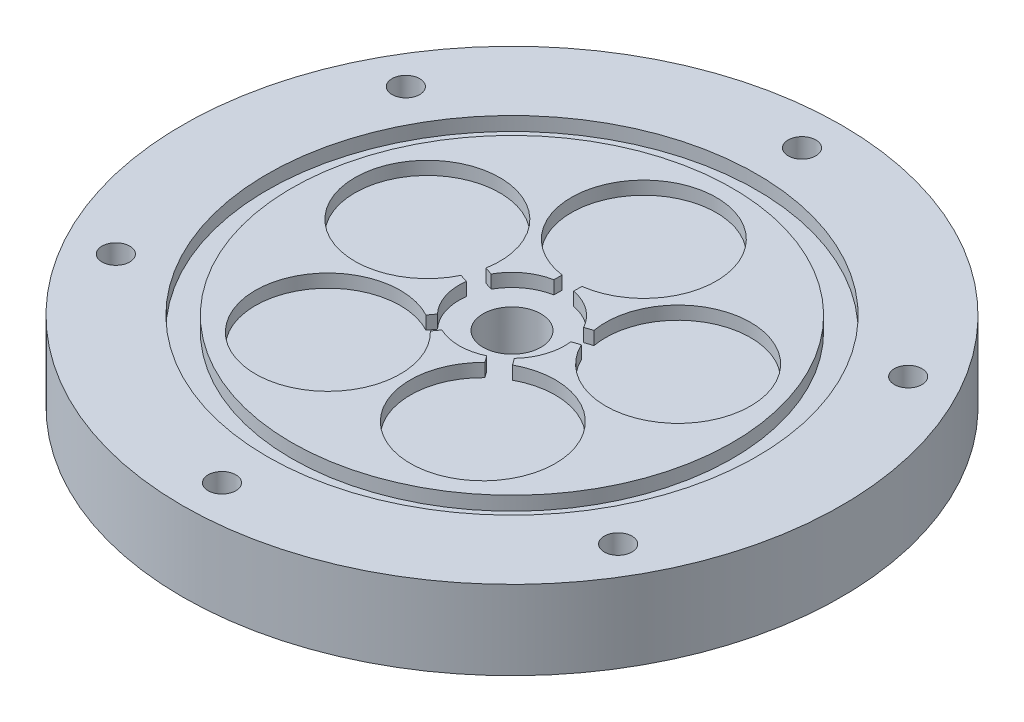
ISO-10303-21;
HEADER;
FILE_DESCRIPTION(('STEP AP214'),'2;1');
FILE_NAME('part.step','',(''),(''),'','','');
FILE_SCHEMA(('AUTOMOTIVE_DESIGN { 1 0 10303 214 1 1 1 1 }'));
ENDSEC;
DATA;
#1=APPLICATION_CONTEXT('core data for automotive mechanical design processes');
#2=APPLICATION_PROTOCOL_DEFINITION('international standard','automotive_design',2000,#1);
#3=PRODUCT_CONTEXT('',#1,'mechanical');
#4=PRODUCT('Part','Part','',(#3));
#5=PRODUCT_RELATED_PRODUCT_CATEGORY('part','',(#4));
#6=PRODUCT_DEFINITION_FORMATION('','',#4);
#7=PRODUCT_DEFINITION_CONTEXT('part definition',#1,'design');
#8=PRODUCT_DEFINITION('design','',#6,#7);
#9=PRODUCT_DEFINITION_SHAPE('','',#8);
#10=(LENGTH_UNIT() NAMED_UNIT(*) SI_UNIT(.MILLI.,.METRE.));
#11=(NAMED_UNIT(*) PLANE_ANGLE_UNIT() SI_UNIT($,.RADIAN.));
#12=(NAMED_UNIT(*) SI_UNIT($,.STERADIAN.) SOLID_ANGLE_UNIT());
#13=UNCERTAINTY_MEASURE_WITH_UNIT(LENGTH_MEASURE(1.E-05),#10,'distance_accuracy_value','');
#14=(GEOMETRIC_REPRESENTATION_CONTEXT(3) GLOBAL_UNCERTAINTY_ASSIGNED_CONTEXT((#13)) GLOBAL_UNIT_ASSIGNED_CONTEXT((#10,
#11,#12)) REPRESENTATION_CONTEXT('',''));
#15=CARTESIAN_POINT('',(0.,0.,0.));
#16=DIRECTION('',(0.,0.,1.));
#17=DIRECTION('',(1.,0.,0.));
#18=AXIS2_PLACEMENT_3D('',#15,#16,#17);
#19=CARTESIAN_POINT('',(0.,0.,0.));
#20=DIRECTION('',(0.,1.,0.));
#21=DIRECTION('',(0.,0.,1.));
#22=AXIS2_PLACEMENT_3D('',#19,#20,#21);
#23=PLANE('',#22);
#24=CARTESIAN_POINT('',(0.,0.,0.));
#25=DIRECTION('',(0.,1.,0.));
#26=DIRECTION('',(0.,0.,1.));
#27=AXIS2_PLACEMENT_3D('',#24,#25,#26);
#28=CIRCLE('',#27,33.435);
#29=CARTESIAN_POINT('',(0.,0.,33.435));
#30=VERTEX_POINT('',#29);
#31=EDGE_CURVE('E47',#30,#30,#28,.T.);
#32=ORIENTED_EDGE('',*,*,#31,.T.);
#33=EDGE_LOOP('',(#32));
#34=FACE_BOUND('',#33,.T.);
#35=DIRECTION('',(-0.951056516295155,0.,-0.309016994374945));
#36=VECTOR('',#35,1.);
#37=CARTESIAN_POINT('',(-18.5576048343407,0.,-7.60692466194163));
#38=LINE('',#37,#36);
#39=CARTESIAN_POINT('',(-7.00998771852336,0.,-3.85487641645639));
#40=VERTEX_POINT('',#39);
#41=CARTESIAN_POINT('',(-8.19370672402462,0.,-4.23949003614898));
#42=VERTEX_POINT('',#41);
#43=EDGE_CURVE('E385',#40,#42,#38,.T.);
#44=ORIENTED_EDGE('',*,*,#43,.F.);
#45=CARTESIAN_POINT('',(0.,0.,0.));
#46=DIRECTION('',(0.,1.,0.));
#47=DIRECTION('',(0.,0.,1.));
#48=AXIS2_PLACEMENT_3D('',#45,#46,#47);
#49=CIRCLE('',#48,8.);
#50=CARTESIAN_POINT('',(-1.5,0.,-7.85811682275086));
#51=VERTEX_POINT('',#50);
#52=EDGE_CURVE('E224',#51,#40,#49,.T.);
#53=ORIENTED_EDGE('',*,*,#52,.F.);
#54=DIRECTION('',(0.,0.,1.));
#55=VECTOR('',#54,1.);
#56=CARTESIAN_POINT('',(-1.5,0.,-20.));
#57=LINE('',#56,#55);
#58=CARTESIAN_POINT('',(-1.5,0.,-9.10275264114832));
#59=VERTEX_POINT('',#58);
#60=EDGE_CURVE('E318',#59,#51,#57,.T.);
#61=ORIENTED_EDGE('',*,*,#60,.F.);
#62=CARTESIAN_POINT('',(0.,0.,-20.));
#63=DIRECTION('',(0.,1.,0.));
#64=DIRECTION('',(0.,0.,1.));
#65=AXIS2_PLACEMENT_3D('',#62,#63,#64);
#66=CIRCLE('',#65,11.);
#67=CARTESIAN_POINT('',(1.5,0.,-9.10275264114832));
#68=VERTEX_POINT('',#67);
#69=EDGE_CURVE('E212',#68,#59,#66,.T.);
#70=ORIENTED_EDGE('',*,*,#69,.F.);
#71=DIRECTION('',(0.,0.,-1.));
#72=VECTOR('',#71,1.);
#73=CARTESIAN_POINT('',(1.5,0.,-20.));
#74=LINE('',#73,#72);
#75=CARTESIAN_POINT('',(1.5,0.,-7.85811682275086));
#76=VERTEX_POINT('',#75);
#77=EDGE_CURVE('E322',#76,#68,#74,.T.);
#78=ORIENTED_EDGE('',*,*,#77,.F.);
#79=CARTESIAN_POINT('',(7.00998771852331,0.,-3.85487641645649));
#80=VERTEX_POINT('',#79);
#81=EDGE_CURVE('E232',#80,#76,#49,.T.);
#82=ORIENTED_EDGE('',*,*,#81,.F.);
#83=DIRECTION('',(-0.95105651629515,0.,0.309016994374958));
#84=VECTOR('',#83,1.);
#85=CARTESIAN_POINT('',(18.5576048343406,0.,-7.60692466194189));
#86=LINE('',#85,#84);
#87=CARTESIAN_POINT('',(8.19370672402456,0.,-4.23949003614909));
#88=VERTEX_POINT('',#87);
#89=EDGE_CURVE('E189',#88,#80,#86,.T.);
#90=ORIENTED_EDGE('',*,*,#89,.F.);
#91=CARTESIAN_POINT('',(19.021130325903,0.,-6.18033988749916));
#92=DIRECTION('',(0.,1.,0.));
#93=DIRECTION('',(-0.95105651629515,0.,0.309016994374958));
#94=AXIS2_PLACEMENT_3D('',#91,#92,#93);
#95=CIRCLE('',#94,11.);
#96=CARTESIAN_POINT('',(9.12075770714943,0.,-1.38632048726364));
#97=VERTEX_POINT('',#96);
#98=EDGE_CURVE('E890',#97,#88,#95,.T.);
#99=ORIENTED_EDGE('',*,*,#98,.F.);
#100=DIRECTION('',(0.95105651629515,0.,-0.309016994374958));
#101=VECTOR('',#100,1.);
#102=CARTESIAN_POINT('',(19.4846558174654,0.,-4.75375511305644));
#103=LINE('',#102,#101);
#104=CARTESIAN_POINT('',(7.93703870164818,0.,-1.00170686757104));
#105=VERTEX_POINT('',#104);
#106=EDGE_CURVE('E340',#105,#97,#103,.T.);
#107=ORIENTED_EDGE('',*,*,#106,.F.);
#108=CARTESIAN_POINT('',(5.83241067076681,0.,5.47567217495035));
#109=VERTEX_POINT('',#108);
#110=EDGE_CURVE('E237',#109,#105,#49,.T.);
#111=ORIENTED_EDGE('',*,*,#110,.F.);
#112=DIRECTION('',(-0.58778525229248,0.,-0.809016994374942));
#113=VECTOR('',#112,1.);
#114=CARTESIAN_POINT('',(12.969230537412,0.,15.2986620090601));
#115=LINE('',#114,#113);
#116=CARTESIAN_POINT('',(6.56398924929582,0.,6.48260370384166));
#117=VERTEX_POINT('',#116);
#118=EDGE_CURVE('E205',#117,#109,#115,.T.);
#119=ORIENTED_EDGE('',*,*,#118,.F.);
#120=CARTESIAN_POINT('',(11.7557050458496,0.,16.1803398874988));
#121=DIRECTION('',(0.,1.,0.));
#122=DIRECTION('',(-0.58778525229248,0.,-0.809016994374942));
#123=AXIS2_PLACEMENT_3D('',#120,#121,#122);
#124=CIRCLE('',#123,11.);
#125=CARTESIAN_POINT('',(4.13693826617099,0.,8.2459594607191));
#126=VERTEX_POINT('',#125);
#127=EDGE_CURVE('E970',#126,#117,#124,.T.);
#128=ORIENTED_EDGE('',*,*,#127,.F.);
#129=DIRECTION('',(0.58778525229248,0.,0.809016994374942));
#130=VECTOR('',#129,1.);
#131=CARTESIAN_POINT('',(10.5421795542872,0.,17.0620177659376));
#132=LINE('',#131,#130);
#133=CARTESIAN_POINT('',(3.40535968764198,0.,7.23902793182779));
#134=VERTEX_POINT('',#133);
#135=EDGE_CURVE('E353',#134,#126,#132,.T.);
#136=ORIENTED_EDGE('',*,*,#135,.F.);
#137=CARTESIAN_POINT('',(-3.40535968764188,0.,7.23902793182784));
#138=VERTEX_POINT('',#137);
#139=EDGE_CURVE('E235',#138,#134,#49,.T.);
#140=ORIENTED_EDGE('',*,*,#139,.F.);
#141=DIRECTION('',(0.587785252292469,0.,-0.809016994374951));
#142=VECTOR('',#141,1.);
#143=CARTESIAN_POINT('',(-10.5421795542869,0.,17.0620177659377));
#144=LINE('',#143,#142);
#145=CARTESIAN_POINT('',(-4.13693826617087,0.,8.24595946071916));
#146=VERTEX_POINT('',#145);
#147=EDGE_CURVE('E367',#146,#138,#144,.T.);
#148=ORIENTED_EDGE('',*,*,#147,.F.);
#149=CARTESIAN_POINT('',(-11.7557050458494,0.,16.180339887499));
#150=DIRECTION('',(0.,1.,0.));
#151=DIRECTION('',(0.587785252292469,0.,-0.809016994374951));
#152=AXIS2_PLACEMENT_3D('',#149,#150,#151);
#153=CIRCLE('',#152,11.);
#154=CARTESIAN_POINT('',(-6.56398924929572,0.,6.48260370384175));
#155=VERTEX_POINT('',#154);
#156=EDGE_CURVE('E915',#155,#146,#153,.T.);
#157=ORIENTED_EDGE('',*,*,#156,.F.);
#158=DIRECTION('',(-0.587785252292469,0.,0.809016994374951));
#159=VECTOR('',#158,1.);
#160=CARTESIAN_POINT('',(-12.9692305374118,0.,15.2986620090603));
#161=LINE('',#160,#159);
#162=CARTESIAN_POINT('',(-5.83241067076673,0.,5.47567217495043));
#163=VERTEX_POINT('',#162);
#164=EDGE_CURVE('E370',#163,#155,#161,.T.);
#165=ORIENTED_EDGE('',*,*,#164,.F.);
#166=CARTESIAN_POINT('',(-7.93703870164819,0.,-1.00170686757093));
#167=VERTEX_POINT('',#166);
#168=EDGE_CURVE('E231',#167,#163,#49,.T.);
#169=ORIENTED_EDGE('',*,*,#168,.F.);
#170=DIRECTION('',(0.951056516295155,0.,0.309016994374945));
#171=VECTOR('',#170,1.);
#172=CARTESIAN_POINT('',(-19.4846558174655,0.,-4.75375511305616));
#173=LINE('',#172,#171);
#174=CARTESIAN_POINT('',(-9.12075770714945,0.,-1.38632048726351));
#175=VERTEX_POINT('',#174);
#176=EDGE_CURVE('E382',#175,#167,#173,.T.);
#177=ORIENTED_EDGE('',*,*,#176,.F.);
#178=CARTESIAN_POINT('',(-19.0211303259031,0.,-6.1803398874989));
#179=DIRECTION('',(0.,1.,0.));
#180=DIRECTION('',(0.951056516295155,0.,0.309016994374945));
#181=AXIS2_PLACEMENT_3D('',#178,#179,#180);
#182=CIRCLE('',#181,11.);
#183=EDGE_CURVE('E914',#42,#175,#182,.T.);
#184=ORIENTED_EDGE('',*,*,#183,.F.);
#185=EDGE_LOOP('',(#44,#53,#61,#70,#78,#82,#90,#99,#107,#111,#119,#128,#136,#140,#148,#157,#165,
#169,#177,#184));
#186=FACE_BOUND('',#185,.T.);
#187=ADVANCED_FACE('F43',(#34,#186),#23,.T.);
#188=CARTESIAN_POINT('',(0.,-24.6274169979695,0.));
#189=DIRECTION('',(0.,1.,0.));
#190=DIRECTION('',(0.,0.,1.));
#191=AXIS2_PLACEMENT_3D('',#188,#189,#190);
#192=CYLINDRICAL_SURFACE('',#191,8.);
#193=ORIENTED_EDGE('',*,*,#52,.T.);
#194=DIRECTION('',(0.,1.,0.));
#195=VECTOR('',#194,1.);
#196=CARTESIAN_POINT('',(-7.00998771852336,-24.6274169979695,-3.85487641645639));
#197=LINE('',#196,#195);
#198=CARTESIAN_POINT('',(-7.00998771852336,-2.,-3.85487641645639));
#199=VERTEX_POINT('',#198);
#200=EDGE_CURVE('E886',#40,#199,#197,.F.);
#201=ORIENTED_EDGE('',*,*,#200,.T.);
#202=CARTESIAN_POINT('',(0.,-2.,0.));
#203=DIRECTION('',(0.,1.,0.));
#204=DIRECTION('',(0.,0.,1.));
#205=AXIS2_PLACEMENT_3D('',#202,#203,#204);
#206=CIRCLE('',#205,8.);
#207=CARTESIAN_POINT('',(-1.5,-2.,-7.85811682275086));
#208=VERTEX_POINT('',#207);
#209=EDGE_CURVE('E215',#199,#208,#206,.F.);
#210=ORIENTED_EDGE('',*,*,#209,.T.);
#211=DIRECTION('',(0.,1.,0.));
#212=VECTOR('',#211,1.);
#213=CARTESIAN_POINT('',(-1.5,-24.6274169979695,-7.85811682275086));
#214=LINE('',#213,#212);
#215=EDGE_CURVE('E894',#208,#51,#214,.T.);
#216=ORIENTED_EDGE('',*,*,#215,.T.);
#217=EDGE_LOOP('',(#193,#201,#210,#216));
#218=FACE_BOUND('',#217,.T.);
#219=ADVANCED_FACE('F422',(#218),#192,.F.);
#220=CARTESIAN_POINT('',(-5.83241067076673,-2.,5.47567217495043));
#221=VERTEX_POINT('',#220);
#222=CARTESIAN_POINT('',(-7.93703870164819,-2.,-1.00170686757093));
#223=VERTEX_POINT('',#222);
#224=EDGE_CURVE('E223',#221,#223,#206,.F.);
#225=ORIENTED_EDGE('',*,*,#224,.T.);
#226=DIRECTION('',(0.,1.,0.));
#227=VECTOR('',#226,1.);
#228=CARTESIAN_POINT('',(-7.93703870164819,-24.6274169979695,-1.00170686757093));
#229=LINE('',#228,#227);
#230=EDGE_CURVE('E877',#223,#167,#229,.T.);
#231=ORIENTED_EDGE('',*,*,#230,.T.);
#232=ORIENTED_EDGE('',*,*,#168,.T.);
#233=DIRECTION('',(0.,1.,0.));
#234=VECTOR('',#233,1.);
#235=CARTESIAN_POINT('',(-5.83241067076673,-24.6274169979695,5.47567217495043));
#236=LINE('',#235,#234);
#237=EDGE_CURVE('E879',#163,#221,#236,.F.);
#238=ORIENTED_EDGE('',*,*,#237,.T.);
#239=EDGE_LOOP('',(#225,#231,#232,#238));
#240=FACE_BOUND('',#239,.T.);
#241=ADVANCED_FACE('F427',(#240),#192,.F.);
#242=CARTESIAN_POINT('',(3.40535968764198,-2.,7.23902793182779));
#243=VERTEX_POINT('',#242);
#244=CARTESIAN_POINT('',(-3.40535968764188,-2.,7.23902793182784));
#245=VERTEX_POINT('',#244);
#246=EDGE_CURVE('E220',#243,#245,#206,.F.);
#247=ORIENTED_EDGE('',*,*,#246,.T.);
#248=DIRECTION('',(0.,1.,0.));
#249=VECTOR('',#248,1.);
#250=CARTESIAN_POINT('',(-3.40535968764188,-24.6274169979695,7.23902793182784));
#251=LINE('',#250,#249);
#252=EDGE_CURVE('E939',#245,#138,#251,.T.);
#253=ORIENTED_EDGE('',*,*,#252,.T.);
#254=ORIENTED_EDGE('',*,*,#139,.T.);
#255=DIRECTION('',(0.,1.,0.));
#256=VECTOR('',#255,1.);
#257=CARTESIAN_POINT('',(3.40535968764198,-24.6274169979695,7.23902793182779));
#258=LINE('',#257,#256);
#259=EDGE_CURVE('E952',#134,#243,#258,.F.);
#260=ORIENTED_EDGE('',*,*,#259,.T.);
#261=EDGE_LOOP('',(#247,#253,#254,#260));
#262=FACE_BOUND('',#261,.T.);
#263=ADVANCED_FACE('F418',(#262),#192,.F.);
#264=CARTESIAN_POINT('',(7.93703870164818,-2.,-1.00170686757104));
#265=VERTEX_POINT('',#264);
#266=CARTESIAN_POINT('',(5.83241067076681,-2.,5.47567217495035));
#267=VERTEX_POINT('',#266);
#268=EDGE_CURVE('E213',#265,#267,#206,.F.);
#269=ORIENTED_EDGE('',*,*,#268,.T.);
#270=DIRECTION('',(0.,1.,0.));
#271=VECTOR('',#270,1.);
#272=CARTESIAN_POINT('',(5.83241067076681,-24.6274169979695,5.47567217495035));
#273=LINE('',#272,#271);
#274=EDGE_CURVE('E953',#267,#109,#273,.T.);
#275=ORIENTED_EDGE('',*,*,#274,.T.);
#276=ORIENTED_EDGE('',*,*,#110,.T.);
#277=DIRECTION('',(0.,1.,0.));
#278=VECTOR('',#277,1.);
#279=CARTESIAN_POINT('',(7.93703870164818,-24.6274169979695,-1.00170686757104));
#280=LINE('',#279,#278);
#281=EDGE_CURVE('E1030',#105,#265,#280,.F.);
#282=ORIENTED_EDGE('',*,*,#281,.T.);
#283=EDGE_LOOP('',(#269,#275,#276,#282));
#284=FACE_BOUND('',#283,.T.);
#285=ADVANCED_FACE('F410',(#284),#192,.F.);
#286=CARTESIAN_POINT('',(0.,-12.,0.));
#287=DIRECTION('',(0.,1.,0.));
#288=DIRECTION('',(0.,0.,1.));
#289=AXIS2_PLACEMENT_3D('',#286,#287,#288);
#290=CYLINDRICAL_SURFACE('',#289,50.);
#291=CARTESIAN_POINT('',(0.,-12.,0.));
#292=DIRECTION('',(0.,1.,0.));
#293=DIRECTION('',(0.,0.,1.));
#294=AXIS2_PLACEMENT_3D('',#291,#292,#293);
#295=CIRCLE('',#294,50.);
#296=CARTESIAN_POINT('',(0.,-12.,50.));
#297=VERTEX_POINT('',#296);
#298=EDGE_CURVE('E12',#297,#297,#295,.T.);
#299=ORIENTED_EDGE('',*,*,#298,.T.);
#300=EDGE_LOOP('',(#299));
#301=FACE_BOUND('',#300,.T.);
#302=CARTESIAN_POINT('',(0.,0.,0.));
#303=DIRECTION('',(0.,1.,0.));
#304=DIRECTION('',(0.,0.,1.));
#305=AXIS2_PLACEMENT_3D('',#302,#303,#304);
#306=CIRCLE('',#305,50.);
#307=CARTESIAN_POINT('',(0.,0.,50.));
#308=VERTEX_POINT('',#307);
#309=EDGE_CURVE('E53',#308,#308,#306,.T.);
#310=ORIENTED_EDGE('',*,*,#309,.F.);
#311=EDGE_LOOP('',(#310));
#312=FACE_BOUND('',#311,.T.);
#313=ADVANCED_FACE('F45',(#301,#312),#290,.T.);
#314=CARTESIAN_POINT('',(0.,-12.,0.));
#315=DIRECTION('',(0.,1.,0.));
#316=DIRECTION('',(0.,0.,1.));
#317=AXIS2_PLACEMENT_3D('',#314,#315,#316);
#318=PLANE('',#317);
#319=CARTESIAN_POINT('',(-38.105117766515,-12.,-22.0000000000004));
#320=DIRECTION('',(0.,1.,0.));
#321=DIRECTION('',(0.,0.,1.));
#322=AXIS2_PLACEMENT_3D('',#319,#320,#321);
#323=CIRCLE('',#322,2.1);
#324=CARTESIAN_POINT('',(-38.105117766515,-12.,-19.9000000000004));
#325=VERTEX_POINT('',#324);
#326=EDGE_CURVE('E998',#325,#325,#323,.T.);
#327=ORIENTED_EDGE('',*,*,#326,.T.);
#328=EDGE_LOOP('',(#327));
#329=FACE_BOUND('',#328,.T.);
#330=CARTESIAN_POINT('',(-38.1051177665155,-12.,21.9999999999996));
#331=DIRECTION('',(0.,1.,0.));
#332=DIRECTION('',(0.,0.,1.));
#333=AXIS2_PLACEMENT_3D('',#330,#331,#332);
#334=CIRCLE('',#333,2.1);
#335=CARTESIAN_POINT('',(-38.1051177665155,-12.,24.0999999999996));
#336=VERTEX_POINT('',#335);
#337=EDGE_CURVE('E282',#336,#336,#334,.T.);
#338=ORIENTED_EDGE('',*,*,#337,.T.);
#339=EDGE_LOOP('',(#338));
#340=FACE_BOUND('',#339,.T.);
#341=CARTESIAN_POINT('',(0.,-12.,44.));
#342=DIRECTION('',(0.,1.,0.));
#343=DIRECTION('',(0.,0.,1.));
#344=AXIS2_PLACEMENT_3D('',#341,#342,#343);
#345=CIRCLE('',#344,2.1);
#346=CARTESIAN_POINT('',(0.,-12.,46.1));
#347=VERTEX_POINT('',#346);
#348=EDGE_CURVE('E261',#347,#347,#345,.T.);
#349=ORIENTED_EDGE('',*,*,#348,.T.);
#350=EDGE_LOOP('',(#349));
#351=FACE_BOUND('',#350,.T.);
#352=CARTESIAN_POINT('',(38.1051177665152,-12.,22.0000000000002));
#353=DIRECTION('',(0.,1.,0.));
#354=DIRECTION('',(0.,0.,1.));
#355=AXIS2_PLACEMENT_3D('',#352,#353,#354);
#356=CIRCLE('',#355,2.1);
#357=CARTESIAN_POINT('',(38.1051177665152,-12.,24.1000000000002));
#358=VERTEX_POINT('',#357);
#359=EDGE_CURVE('E260',#358,#358,#356,.T.);
#360=ORIENTED_EDGE('',*,*,#359,.T.);
#361=EDGE_LOOP('',(#360));
#362=FACE_BOUND('',#361,.T.);
#363=CARTESIAN_POINT('',(38.1051177665154,-12.,-21.9999999999999));
#364=DIRECTION('',(0.,1.,0.));
#365=DIRECTION('',(0.,0.,1.));
#366=AXIS2_PLACEMENT_3D('',#363,#364,#365);
#367=CIRCLE('',#366,2.1);
#368=CARTESIAN_POINT('',(38.1051177665154,-12.,-19.8999999999999));
#369=VERTEX_POINT('',#368);
#370=EDGE_CURVE('E271',#369,#369,#367,.T.);
#371=ORIENTED_EDGE('',*,*,#370,.T.);
#372=EDGE_LOOP('',(#371));
#373=FACE_BOUND('',#372,.T.);
#374=CARTESIAN_POINT('',(0.,-12.,-44.));
#375=DIRECTION('',(0.,1.,0.));
#376=DIRECTION('',(0.,0.,1.));
#377=AXIS2_PLACEMENT_3D('',#374,#375,#376);
#378=CIRCLE('',#377,2.1);
#379=CARTESIAN_POINT('',(0.,-12.,-41.9));
#380=VERTEX_POINT('',#379);
#381=EDGE_CURVE('E296',#380,#380,#378,.T.);
#382=ORIENTED_EDGE('',*,*,#381,.T.);
#383=EDGE_LOOP('',(#382));
#384=FACE_BOUND('',#383,.T.);
#385=CARTESIAN_POINT('',(0.,-12.,0.));
#386=DIRECTION('',(0.,-1.,0.));
#387=DIRECTION('',(0.,0.,-1.));
#388=AXIS2_PLACEMENT_3D('',#385,#386,#387);
#389=CIRCLE('',#388,4.39999999999999);
#390=CARTESIAN_POINT('',(0.,-12.,-4.39999999999999));
#391=VERTEX_POINT('',#390);
#392=EDGE_CURVE('E241',#391,#391,#389,.T.);
#393=ORIENTED_EDGE('',*,*,#392,.F.);
#394=EDGE_LOOP('',(#393));
#395=FACE_BOUND('',#394,.T.);
#396=ORIENTED_EDGE('',*,*,#298,.F.);
#397=EDGE_LOOP('',(#396));
#398=FACE_BOUND('',#397,.T.);
#399=ADVANCED_FACE('F409',(#329,#340,#351,#362,#373,#384,#395,#398),#318,.F.);
#400=CARTESIAN_POINT('',(-38.105117766515,0.,-22.0000000000004));
#401=DIRECTION('',(0.,1.,0.));
#402=DIRECTION('',(0.,0.,1.));
#403=AXIS2_PLACEMENT_3D('',#400,#401,#402);
#404=CIRCLE('',#403,2.1);
#405=CARTESIAN_POINT('',(-38.105117766515,0.,-19.9000000000004));
#406=VERTEX_POINT('',#405);
#407=EDGE_CURVE('E441',#406,#406,#404,.T.);
#408=ORIENTED_EDGE('',*,*,#407,.F.);
#409=EDGE_LOOP('',(#408));
#410=FACE_BOUND('',#409,.T.);
#411=CARTESIAN_POINT('',(-38.1051177665155,0.,21.9999999999996));
#412=DIRECTION('',(0.,1.,0.));
#413=DIRECTION('',(0.,0.,1.));
#414=AXIS2_PLACEMENT_3D('',#411,#412,#413);
#415=CIRCLE('',#414,2.1);
#416=CARTESIAN_POINT('',(-38.1051177665155,0.,24.0999999999996));
#417=VERTEX_POINT('',#416);
#418=EDGE_CURVE('E286',#417,#417,#415,.T.);
#419=ORIENTED_EDGE('',*,*,#418,.F.);
#420=EDGE_LOOP('',(#419));
#421=FACE_BOUND('',#420,.T.);
#422=CARTESIAN_POINT('',(0.,0.,44.));
#423=DIRECTION('',(0.,1.,0.));
#424=DIRECTION('',(0.,0.,1.));
#425=AXIS2_PLACEMENT_3D('',#422,#423,#424);
#426=CIRCLE('',#425,2.1);
#427=CARTESIAN_POINT('',(0.,0.,46.1));
#428=VERTEX_POINT('',#427);
#429=EDGE_CURVE('E278',#428,#428,#426,.T.);
#430=ORIENTED_EDGE('',*,*,#429,.F.);
#431=EDGE_LOOP('',(#430));
#432=FACE_BOUND('',#431,.T.);
#433=CARTESIAN_POINT('',(38.1051177665152,0.,22.0000000000002));
#434=DIRECTION('',(0.,1.,0.));
#435=DIRECTION('',(0.,0.,1.));
#436=AXIS2_PLACEMENT_3D('',#433,#434,#435);
#437=CIRCLE('',#436,2.1);
#438=CARTESIAN_POINT('',(38.1051177665152,0.,24.1000000000002));
#439=VERTEX_POINT('',#438);
#440=EDGE_CURVE('E256',#439,#439,#437,.T.);
#441=ORIENTED_EDGE('',*,*,#440,.F.);
#442=EDGE_LOOP('',(#441));
#443=FACE_BOUND('',#442,.T.);
#444=CARTESIAN_POINT('',(38.1051177665154,0.,-21.9999999999999));
#445=DIRECTION('',(0.,1.,0.));
#446=DIRECTION('',(0.,0.,1.));
#447=AXIS2_PLACEMENT_3D('',#444,#445,#446);
#448=CIRCLE('',#447,2.1);
#449=CARTESIAN_POINT('',(38.1051177665154,0.,-19.8999999999999));
#450=VERTEX_POINT('',#449);
#451=EDGE_CURVE('E267',#450,#450,#448,.T.);
#452=ORIENTED_EDGE('',*,*,#451,.F.);
#453=EDGE_LOOP('',(#452));
#454=FACE_BOUND('',#453,.T.);
#455=CARTESIAN_POINT('',(0.,0.,-44.));
#456=DIRECTION('',(0.,1.,0.));
#457=DIRECTION('',(0.,0.,1.));
#458=AXIS2_PLACEMENT_3D('',#455,#456,#457);
#459=CIRCLE('',#458,2.1);
#460=CARTESIAN_POINT('',(0.,0.,-41.9));
#461=VERTEX_POINT('',#460);
#462=EDGE_CURVE('E301',#461,#461,#459,.T.);
#463=ORIENTED_EDGE('',*,*,#462,.F.);
#464=EDGE_LOOP('',(#463));
#465=FACE_BOUND('',#464,.T.);
#466=CARTESIAN_POINT('',(0.,0.,0.));
#467=DIRECTION('',(0.,1.,0.));
#468=DIRECTION('',(0.,0.,1.));
#469=AXIS2_PLACEMENT_3D('',#466,#467,#468);
#470=CIRCLE('',#469,37.135);
#471=CARTESIAN_POINT('',(0.,0.,37.135));
#472=VERTEX_POINT('',#471);
#473=EDGE_CURVE('E250',#472,#472,#470,.F.);
#474=ORIENTED_EDGE('',*,*,#473,.T.);
#475=EDGE_LOOP('',(#474));
#476=FACE_BOUND('',#475,.T.);
#477=ORIENTED_EDGE('',*,*,#309,.T.);
#478=EDGE_LOOP('',(#477));
#479=FACE_BOUND('',#478,.T.);
#480=ADVANCED_FACE('F406',(#410,#421,#432,#443,#454,#465,#476,#479),#23,.T.);
#481=CARTESIAN_POINT('',(0.,-2.,-20.));
#482=DIRECTION('',(0.,1.,0.));
#483=DIRECTION('',(0.,0.,1.));
#484=AXIS2_PLACEMENT_3D('',#481,#482,#483);
#485=CYLINDRICAL_SURFACE('',#484,11.);
#486=CARTESIAN_POINT('',(0.,-2.,-20.));
#487=DIRECTION('',(0.,1.,0.));
#488=DIRECTION('',(0.,0.,1.));
#489=AXIS2_PLACEMENT_3D('',#486,#487,#488);
#490=CIRCLE('',#489,11.);
#491=CARTESIAN_POINT('',(1.5,-2.,-9.10275264114832));
#492=VERTEX_POINT('',#491);
#493=CARTESIAN_POINT('',(-1.5,-2.,-9.10275264114832));
#494=VERTEX_POINT('',#493);
#495=EDGE_CURVE('E217',#492,#494,#490,.T.);
#496=ORIENTED_EDGE('',*,*,#495,.F.);
#497=DIRECTION('',(0.,1.,0.));
#498=VECTOR('',#497,1.);
#499=CARTESIAN_POINT('',(1.5,-2.,-9.10275264114832));
#500=LINE('',#499,#498);
#501=EDGE_CURVE('E246',#492,#68,#500,.T.);
#502=ORIENTED_EDGE('',*,*,#501,.T.);
#503=ORIENTED_EDGE('',*,*,#69,.T.);
#504=DIRECTION('',(0.,1.,0.));
#505=VECTOR('',#504,1.);
#506=CARTESIAN_POINT('',(-1.5,-2.,-9.10275264114832));
#507=LINE('',#506,#505);
#508=EDGE_CURVE('E896',#59,#494,#507,.F.);
#509=ORIENTED_EDGE('',*,*,#508,.T.);
#510=EDGE_LOOP('',(#496,#502,#503,#509));
#511=FACE_BOUND('',#510,.T.);
#512=ADVANCED_FACE('F431',(#511),#485,.F.);
#513=CARTESIAN_POINT('',(0.,-2.,-20.));
#514=DIRECTION('',(0.,1.,0.));
#515=DIRECTION('',(0.,0.,1.));
#516=AXIS2_PLACEMENT_3D('',#513,#514,#515);
#517=PLANE('',#516);
#518=ORIENTED_EDGE('',*,*,#209,.F.);
#519=DIRECTION('',(0.951056516295155,0.,0.309016994374945));
#520=VECTOR('',#519,1.);
#521=CARTESIAN_POINT('',(-18.5576048343407,-2.,-7.60692466194163));
#522=LINE('',#521,#520);
#523=CARTESIAN_POINT('',(-8.19370672402462,-2.,-4.23949003614898));
#524=VERTEX_POINT('',#523);
#525=EDGE_CURVE('E61',#524,#199,#522,.T.);
#526=ORIENTED_EDGE('',*,*,#525,.F.);
#527=CARTESIAN_POINT('',(-19.0211303259031,-2.,-6.1803398874989));
#528=DIRECTION('',(0.,1.,0.));
#529=DIRECTION('',(0.951056516295155,0.,0.309016994374945));
#530=AXIS2_PLACEMENT_3D('',#527,#528,#529);
#531=CIRCLE('',#530,11.);
#532=CARTESIAN_POINT('',(-9.12075770714945,-2.,-1.38632048726351));
#533=VERTEX_POINT('',#532);
#534=EDGE_CURVE('E323',#524,#533,#531,.T.);
#535=ORIENTED_EDGE('',*,*,#534,.T.);
#536=DIRECTION('',(-0.951056516295155,0.,-0.309016994374945));
#537=VECTOR('',#536,1.);
#538=CARTESIAN_POINT('',(-19.4846558174655,-2.,-4.75375511305616));
#539=LINE('',#538,#537);
#540=EDGE_CURVE('E389',#223,#533,#539,.T.);
#541=ORIENTED_EDGE('',*,*,#540,.F.);
#542=ORIENTED_EDGE('',*,*,#224,.F.);
#543=DIRECTION('',(0.587785252292469,0.,-0.809016994374951));
#544=VECTOR('',#543,1.);
#545=CARTESIAN_POINT('',(-12.9692305374118,-2.,15.2986620090603));
#546=LINE('',#545,#544);
#547=CARTESIAN_POINT('',(-6.56398924929572,-2.,6.48260370384175));
#548=VERTEX_POINT('',#547);
#549=EDGE_CURVE('E371',#548,#221,#546,.T.);
#550=ORIENTED_EDGE('',*,*,#549,.F.);
#551=CARTESIAN_POINT('',(-11.7557050458494,-2.,16.180339887499));
#552=DIRECTION('',(0.,1.,0.));
#553=DIRECTION('',(0.587785252292469,0.,-0.809016994374951));
#554=AXIS2_PLACEMENT_3D('',#551,#552,#553);
#555=CIRCLE('',#554,11.);
#556=CARTESIAN_POINT('',(-4.13693826617087,-2.,8.24595946071916));
#557=VERTEX_POINT('',#556);
#558=EDGE_CURVE('E912',#548,#557,#555,.T.);
#559=ORIENTED_EDGE('',*,*,#558,.T.);
#560=DIRECTION('',(-0.587785252292469,0.,0.809016994374951));
#561=VECTOR('',#560,1.);
#562=CARTESIAN_POINT('',(-10.5421795542869,-2.,17.0620177659377));
#563=LINE('',#562,#561);
#564=EDGE_CURVE('E69',#245,#557,#563,.T.);
#565=ORIENTED_EDGE('',*,*,#564,.F.);
#566=ORIENTED_EDGE('',*,*,#246,.F.);
#567=DIRECTION('',(-0.58778525229248,0.,-0.809016994374942));
#568=VECTOR('',#567,1.);
#569=CARTESIAN_POINT('',(10.5421795542872,-2.,17.0620177659376));
#570=LINE('',#569,#568);
#571=CARTESIAN_POINT('',(4.13693826617099,-2.,8.2459594607191));
#572=VERTEX_POINT('',#571);
#573=EDGE_CURVE('E354',#572,#243,#570,.T.);
#574=ORIENTED_EDGE('',*,*,#573,.F.);
#575=CARTESIAN_POINT('',(11.7557050458496,-2.,16.1803398874988));
#576=DIRECTION('',(0.,1.,0.));
#577=DIRECTION('',(-0.58778525229248,0.,-0.809016994374942));
#578=AXIS2_PLACEMENT_3D('',#575,#576,#577);
#579=CIRCLE('',#578,11.);
#580=CARTESIAN_POINT('',(6.56398924929582,-2.,6.48260370384166));
#581=VERTEX_POINT('',#580);
#582=EDGE_CURVE('E975',#572,#581,#579,.T.);
#583=ORIENTED_EDGE('',*,*,#582,.T.);
#584=DIRECTION('',(0.58778525229248,0.,0.809016994374942));
#585=VECTOR('',#584,1.);
#586=CARTESIAN_POINT('',(12.969230537412,-2.,15.2986620090601));
#587=LINE('',#586,#585);
#588=EDGE_CURVE('E358',#267,#581,#587,.T.);
#589=ORIENTED_EDGE('',*,*,#588,.F.);
#590=ORIENTED_EDGE('',*,*,#268,.F.);
#591=DIRECTION('',(-0.95105651629515,0.,0.309016994374958));
#592=VECTOR('',#591,1.);
#593=CARTESIAN_POINT('',(19.4846558174654,-2.,-4.75375511305644));
#594=LINE('',#593,#592);
#595=CARTESIAN_POINT('',(9.12075770714943,-2.,-1.38632048726364));
#596=VERTEX_POINT('',#595);
#597=EDGE_CURVE('E206',#596,#265,#594,.T.);
#598=ORIENTED_EDGE('',*,*,#597,.F.);
#599=CARTESIAN_POINT('',(19.021130325903,-2.,-6.18033988749916));
#600=DIRECTION('',(0.,1.,0.));
#601=DIRECTION('',(-0.95105651629515,0.,0.309016994374958));
#602=AXIS2_PLACEMENT_3D('',#599,#600,#601);
#603=CIRCLE('',#602,11.);
#604=CARTESIAN_POINT('',(8.19370672402456,-2.,-4.23949003614909));
#605=VERTEX_POINT('',#604);
#606=EDGE_CURVE('E204',#596,#605,#603,.T.);
#607=ORIENTED_EDGE('',*,*,#606,.T.);
#608=DIRECTION('',(0.95105651629515,0.,-0.309016994374958));
#609=VECTOR('',#608,1.);
#610=CARTESIAN_POINT('',(18.5576048343406,-2.,-7.60692466194189));
#611=LINE('',#610,#609);
#612=CARTESIAN_POINT('',(7.00998771852331,-2.,-3.85487641645649));
#613=VERTEX_POINT('',#612);
#614=EDGE_CURVE('E186',#613,#605,#611,.T.);
#615=ORIENTED_EDGE('',*,*,#614,.F.);
#616=CARTESIAN_POINT('',(1.5,-2.,-7.85811682275086));
#617=VERTEX_POINT('',#616);
#618=EDGE_CURVE('E201',#617,#613,#206,.F.);
#619=ORIENTED_EDGE('',*,*,#618,.F.);
#620=DIRECTION('',(0.,0.,1.));
#621=VECTOR('',#620,1.);
#622=CARTESIAN_POINT('',(1.5,-2.,-20.));
#623=LINE('',#622,#621);
#624=EDGE_CURVE('E324',#492,#617,#623,.T.);
#625=ORIENTED_EDGE('',*,*,#624,.F.);
#626=ORIENTED_EDGE('',*,*,#495,.T.);
#627=DIRECTION('',(0.,0.,-1.));
#628=VECTOR('',#627,1.);
#629=CARTESIAN_POINT('',(-1.5,-2.,-20.));
#630=LINE('',#629,#628);
#631=EDGE_CURVE('E329',#208,#494,#630,.T.);
#632=ORIENTED_EDGE('',*,*,#631,.F.);
#633=EDGE_LOOP('',(#518,#526,#535,#541,#542,#550,#559,#565,#566,#574,#583,#589,#590,#598,#607,
#615,#619,#625,#626,#632));
#634=FACE_BOUND('',#633,.T.);
#635=CARTESIAN_POINT('',(0.,-2.,0.));
#636=DIRECTION('',(0.,1.,0.));
#637=DIRECTION('',(0.,0.,1.));
#638=AXIS2_PLACEMENT_3D('',#635,#636,#637);
#639=CIRCLE('',#638,4.39999999999999);
#640=CARTESIAN_POINT('',(0.,-2.,4.39999999999999));
#641=VERTEX_POINT('',#640);
#642=EDGE_CURVE('E238',#641,#641,#639,.T.);
#643=ORIENTED_EDGE('',*,*,#642,.F.);
#644=EDGE_LOOP('',(#643));
#645=FACE_BOUND('',#644,.T.);
#646=ADVANCED_FACE('F198',(#634,#645),#517,.T.);
#647=ORIENTED_EDGE('',*,*,#618,.T.);
#648=DIRECTION('',(0.,1.,0.));
#649=VECTOR('',#648,1.);
#650=CARTESIAN_POINT('',(7.0099877185233,-24.6274169979695,-3.85487641645649));
#651=LINE('',#650,#649);
#652=EDGE_CURVE('E183',#613,#80,#651,.T.);
#653=ORIENTED_EDGE('',*,*,#652,.T.);
#654=ORIENTED_EDGE('',*,*,#81,.T.);
#655=DIRECTION('',(0.,1.,0.));
#656=VECTOR('',#655,1.);
#657=CARTESIAN_POINT('',(1.5,-24.6274169979695,-7.85811682275086));
#658=LINE('',#657,#656);
#659=EDGE_CURVE('E211',#76,#617,#658,.F.);
#660=ORIENTED_EDGE('',*,*,#659,.T.);
#661=EDGE_LOOP('',(#647,#653,#654,#660));
#662=FACE_BOUND('',#661,.T.);
#663=ADVANCED_FACE('F209',(#662),#192,.F.);
#664=CARTESIAN_POINT('',(0.,-12.,0.));
#665=DIRECTION('',(0.,-1.,0.));
#666=DIRECTION('',(0.,0.,-1.));
#667=AXIS2_PLACEMENT_3D('',#664,#665,#666);
#668=CYLINDRICAL_SURFACE('',#667,4.39999999999999);
#669=ORIENTED_EDGE('',*,*,#642,.T.);
#670=EDGE_LOOP('',(#669));
#671=FACE_BOUND('',#670,.T.);
#672=ORIENTED_EDGE('',*,*,#392,.T.);
#673=EDGE_LOOP('',(#672));
#674=FACE_BOUND('',#673,.T.);
#675=ADVANCED_FACE('F526',(#671,#674),#668,.F.);
#676=CARTESIAN_POINT('',(1.5,-25.1948270094864,-20.));
#677=DIRECTION('',(1.,0.,0.));
#678=DIRECTION('',(0.,0.,-1.));
#679=AXIS2_PLACEMENT_3D('',#676,#677,#678);
#680=PLANE('',#679);
#681=ORIENTED_EDGE('',*,*,#624,.T.);
#682=ORIENTED_EDGE('',*,*,#659,.F.);
#683=ORIENTED_EDGE('',*,*,#77,.T.);
#684=ORIENTED_EDGE('',*,*,#501,.F.);
#685=EDGE_LOOP('',(#681,#682,#683,#684));
#686=FACE_BOUND('',#685,.T.);
#687=ADVANCED_FACE('F523',(#686),#680,.F.);
#688=CARTESIAN_POINT('',(-1.5,-25.1948270094864,-20.));
#689=DIRECTION('',(-1.,0.,0.));
#690=DIRECTION('',(0.,0.,1.));
#691=AXIS2_PLACEMENT_3D('',#688,#689,#690);
#692=PLANE('',#691);
#693=ORIENTED_EDGE('',*,*,#60,.T.);
#694=ORIENTED_EDGE('',*,*,#215,.F.);
#695=ORIENTED_EDGE('',*,*,#631,.T.);
#696=ORIENTED_EDGE('',*,*,#508,.F.);
#697=EDGE_LOOP('',(#693,#694,#695,#696));
#698=FACE_BOUND('',#697,.T.);
#699=ADVANCED_FACE('F521',(#698),#692,.F.);
#700=CARTESIAN_POINT('',(-19.0211303259031,-2.,-6.1803398874989));
#701=DIRECTION('',(0.,1.,0.));
#702=DIRECTION('',(0.,0.,1.));
#703=AXIS2_PLACEMENT_3D('',#700,#701,#702);
#704=CYLINDRICAL_SURFACE('',#703,11.);
#705=ORIENTED_EDGE('',*,*,#534,.F.);
#706=DIRECTION('',(0.,1.,0.));
#707=VECTOR('',#706,1.);
#708=CARTESIAN_POINT('',(-8.19370672402462,-2.,-4.23949003614898));
#709=LINE('',#708,#707);
#710=EDGE_CURVE('E889',#524,#42,#709,.T.);
#711=ORIENTED_EDGE('',*,*,#710,.T.);
#712=ORIENTED_EDGE('',*,*,#183,.T.);
#713=DIRECTION('',(0.,1.,0.));
#714=VECTOR('',#713,1.);
#715=CARTESIAN_POINT('',(-9.12075770714946,-2.,-1.38632048726351));
#716=LINE('',#715,#714);
#717=EDGE_CURVE('E930',#175,#533,#716,.F.);
#718=ORIENTED_EDGE('',*,*,#717,.T.);
#719=EDGE_LOOP('',(#705,#711,#712,#718));
#720=FACE_BOUND('',#719,.T.);
#721=ADVANCED_FACE('F511',(#720),#704,.F.);
#722=CARTESIAN_POINT('',(-11.7557050458494,-2.,16.180339887499));
#723=DIRECTION('',(0.,1.,0.));
#724=DIRECTION('',(0.,0.,1.));
#725=AXIS2_PLACEMENT_3D('',#722,#723,#724);
#726=CYLINDRICAL_SURFACE('',#725,11.);
#727=ORIENTED_EDGE('',*,*,#558,.F.);
#728=DIRECTION('',(0.,1.,0.));
#729=VECTOR('',#728,1.);
#730=CARTESIAN_POINT('',(-6.56398924929572,-2.,6.48260370384175));
#731=LINE('',#730,#729);
#732=EDGE_CURVE('E933',#548,#155,#731,.T.);
#733=ORIENTED_EDGE('',*,*,#732,.T.);
#734=ORIENTED_EDGE('',*,*,#156,.T.);
#735=DIRECTION('',(0.,1.,0.));
#736=VECTOR('',#735,1.);
#737=CARTESIAN_POINT('',(-4.13693826617087,-2.,8.24595946071916));
#738=LINE('',#737,#736);
#739=EDGE_CURVE('E957',#146,#557,#738,.F.);
#740=ORIENTED_EDGE('',*,*,#739,.T.);
#741=EDGE_LOOP('',(#727,#733,#734,#740));
#742=FACE_BOUND('',#741,.T.);
#743=ADVANCED_FACE('F507',(#742),#726,.F.);
#744=CARTESIAN_POINT('',(11.7557050458496,-2.,16.1803398874988));
#745=DIRECTION('',(0.,1.,0.));
#746=DIRECTION('',(0.,0.,1.));
#747=AXIS2_PLACEMENT_3D('',#744,#745,#746);
#748=CYLINDRICAL_SURFACE('',#747,11.);
#749=ORIENTED_EDGE('',*,*,#582,.F.);
#750=DIRECTION('',(0.,1.,0.));
#751=VECTOR('',#750,1.);
#752=CARTESIAN_POINT('',(4.13693826617099,-2.,8.2459594607191));
#753=LINE('',#752,#751);
#754=EDGE_CURVE('E948',#572,#126,#753,.T.);
#755=ORIENTED_EDGE('',*,*,#754,.T.);
#756=ORIENTED_EDGE('',*,*,#127,.T.);
#757=DIRECTION('',(0.,1.,0.));
#758=VECTOR('',#757,1.);
#759=CARTESIAN_POINT('',(6.56398924929582,-2.,6.48260370384166));
#760=LINE('',#759,#758);
#761=EDGE_CURVE('E976',#117,#581,#760,.F.);
#762=ORIENTED_EDGE('',*,*,#761,.T.);
#763=EDGE_LOOP('',(#749,#755,#756,#762));
#764=FACE_BOUND('',#763,.T.);
#765=ADVANCED_FACE('F510',(#764),#748,.F.);
#766=CARTESIAN_POINT('',(19.021130325903,-2.,-6.18033988749916));
#767=DIRECTION('',(0.,1.,0.));
#768=DIRECTION('',(0.,0.,1.));
#769=AXIS2_PLACEMENT_3D('',#766,#767,#768);
#770=CYLINDRICAL_SURFACE('',#769,11.);
#771=ORIENTED_EDGE('',*,*,#606,.F.);
#772=DIRECTION('',(0.,1.,0.));
#773=VECTOR('',#772,1.);
#774=CARTESIAN_POINT('',(9.12075770714943,-2.,-1.38632048726364));
#775=LINE('',#774,#773);
#776=EDGE_CURVE('E193',#596,#97,#775,.T.);
#777=ORIENTED_EDGE('',*,*,#776,.T.);
#778=ORIENTED_EDGE('',*,*,#98,.T.);
#779=DIRECTION('',(0.,1.,0.));
#780=VECTOR('',#779,1.);
#781=CARTESIAN_POINT('',(8.19370672402456,-2.,-4.23949003614909));
#782=LINE('',#781,#780);
#783=EDGE_CURVE('E194',#88,#605,#782,.F.);
#784=ORIENTED_EDGE('',*,*,#783,.T.);
#785=EDGE_LOOP('',(#771,#777,#778,#784));
#786=FACE_BOUND('',#785,.T.);
#787=ADVANCED_FACE('F481',(#786),#770,.F.);
#788=CARTESIAN_POINT('',(19.4846558174654,-25.8580976039669,-4.75375511305644));
#789=DIRECTION('',(0.309016994374958,0.,0.95105651629515));
#790=DIRECTION('',(0.95105651629515,0.,-0.309016994374958));
#791=AXIS2_PLACEMENT_3D('',#788,#789,#790);
#792=PLANE('',#791);
#793=ORIENTED_EDGE('',*,*,#106,.T.);
#794=ORIENTED_EDGE('',*,*,#776,.F.);
#795=ORIENTED_EDGE('',*,*,#597,.T.);
#796=ORIENTED_EDGE('',*,*,#281,.F.);
#797=EDGE_LOOP('',(#793,#794,#795,#796));
#798=FACE_BOUND('',#797,.T.);
#799=ADVANCED_FACE('F478',(#798),#792,.F.);
#800=CARTESIAN_POINT('',(18.5576048343406,-25.8580976039669,-7.60692466194189));
#801=DIRECTION('',(-0.309016994374958,0.,-0.95105651629515));
#802=DIRECTION('',(-0.95105651629515,0.,0.309016994374958));
#803=AXIS2_PLACEMENT_3D('',#800,#801,#802);
#804=PLANE('',#803);
#805=ORIENTED_EDGE('',*,*,#614,.T.);
#806=ORIENTED_EDGE('',*,*,#783,.F.);
#807=ORIENTED_EDGE('',*,*,#89,.T.);
#808=ORIENTED_EDGE('',*,*,#652,.F.);
#809=EDGE_LOOP('',(#805,#806,#807,#808));
#810=FACE_BOUND('',#809,.T.);
#811=ADVANCED_FACE('F185',(#810),#804,.F.);
#812=CARTESIAN_POINT('',(10.5421795542872,-26.1995096975143,17.0620177659376));
#813=DIRECTION('',(-0.809016994374942,0.,0.58778525229248));
#814=DIRECTION('',(0.58778525229248,0.,0.809016994374942));
#815=AXIS2_PLACEMENT_3D('',#812,#813,#814);
#816=PLANE('',#815);
#817=ORIENTED_EDGE('',*,*,#135,.T.);
#818=ORIENTED_EDGE('',*,*,#754,.F.);
#819=ORIENTED_EDGE('',*,*,#573,.T.);
#820=ORIENTED_EDGE('',*,*,#259,.F.);
#821=EDGE_LOOP('',(#817,#818,#819,#820));
#822=FACE_BOUND('',#821,.T.);
#823=ADVANCED_FACE('F485',(#822),#816,.F.);
#824=CARTESIAN_POINT('',(12.969230537412,-26.1995096975143,15.2986620090601));
#825=DIRECTION('',(0.809016994374942,0.,-0.58778525229248));
#826=DIRECTION('',(-0.58778525229248,0.,-0.809016994374942));
#827=AXIS2_PLACEMENT_3D('',#824,#825,#826);
#828=PLANE('',#827);
#829=ORIENTED_EDGE('',*,*,#588,.T.);
#830=ORIENTED_EDGE('',*,*,#761,.F.);
#831=ORIENTED_EDGE('',*,*,#118,.T.);
#832=ORIENTED_EDGE('',*,*,#274,.F.);
#833=EDGE_LOOP('',(#829,#830,#831,#832));
#834=FACE_BOUND('',#833,.T.);
#835=ADVANCED_FACE('F488',(#834),#828,.F.);
#836=CARTESIAN_POINT('',(-12.9692305374118,-26.1995096975143,15.2986620090603));
#837=DIRECTION('',(-0.809016994374951,0.,-0.587785252292469));
#838=DIRECTION('',(-0.587785252292469,0.,0.809016994374951));
#839=AXIS2_PLACEMENT_3D('',#836,#837,#838);
#840=PLANE('',#839);
#841=ORIENTED_EDGE('',*,*,#164,.T.);
#842=ORIENTED_EDGE('',*,*,#732,.F.);
#843=ORIENTED_EDGE('',*,*,#549,.T.);
#844=ORIENTED_EDGE('',*,*,#237,.F.);
#845=EDGE_LOOP('',(#841,#842,#843,#844));
#846=FACE_BOUND('',#845,.T.);
#847=ADVANCED_FACE('F492',(#846),#840,.F.);
#848=CARTESIAN_POINT('',(-10.5421795542869,-26.1995096975143,17.0620177659377));
#849=DIRECTION('',(0.809016994374951,0.,0.587785252292469));
#850=DIRECTION('',(0.587785252292469,0.,-0.809016994374951));
#851=AXIS2_PLACEMENT_3D('',#848,#849,#850);
#852=PLANE('',#851);
#853=ORIENTED_EDGE('',*,*,#564,.T.);
#854=ORIENTED_EDGE('',*,*,#739,.F.);
#855=ORIENTED_EDGE('',*,*,#147,.T.);
#856=ORIENTED_EDGE('',*,*,#252,.F.);
#857=EDGE_LOOP('',(#853,#854,#855,#856));
#858=FACE_BOUND('',#857,.T.);
#859=ADVANCED_FACE('F496',(#858),#852,.F.);
#860=CARTESIAN_POINT('',(-18.5576048343407,-25.8580976039669,-7.60692466194163));
#861=DIRECTION('',(0.309016994374945,0.,-0.951056516295155));
#862=DIRECTION('',(-0.951056516295155,0.,-0.309016994374945));
#863=AXIS2_PLACEMENT_3D('',#860,#861,#862);
#864=PLANE('',#863);
#865=ORIENTED_EDGE('',*,*,#43,.T.);
#866=ORIENTED_EDGE('',*,*,#710,.F.);
#867=ORIENTED_EDGE('',*,*,#525,.T.);
#868=ORIENTED_EDGE('',*,*,#200,.F.);
#869=EDGE_LOOP('',(#865,#866,#867,#868));
#870=FACE_BOUND('',#869,.T.);
#871=ADVANCED_FACE('F500',(#870),#864,.F.);
#872=CARTESIAN_POINT('',(-19.4846558174655,-25.8580976039669,-4.75375511305616));
#873=DIRECTION('',(-0.309016994374945,0.,0.951056516295155));
#874=DIRECTION('',(0.951056516295155,0.,0.309016994374945));
#875=AXIS2_PLACEMENT_3D('',#872,#873,#874);
#876=PLANE('',#875);
#877=ORIENTED_EDGE('',*,*,#540,.T.);
#878=ORIENTED_EDGE('',*,*,#717,.F.);
#879=ORIENTED_EDGE('',*,*,#176,.T.);
#880=ORIENTED_EDGE('',*,*,#230,.F.);
#881=EDGE_LOOP('',(#877,#878,#879,#880));
#882=FACE_BOUND('',#881,.T.);
#883=ADVANCED_FACE('F473',(#882),#876,.F.);
#884=CARTESIAN_POINT('',(0.,0.,0.));
#885=DIRECTION('',(0.,1.,0.));
#886=DIRECTION('',(0.,0.,1.));
#887=AXIS2_PLACEMENT_3D('',#884,#885,#886);
#888=CYLINDRICAL_SURFACE('',#887,33.435);
#889=ORIENTED_EDGE('',*,*,#31,.F.);
#890=EDGE_LOOP('',(#889));
#891=FACE_BOUND('',#890,.T.);
#892=CARTESIAN_POINT('',(0.,-2.1,0.));
#893=DIRECTION('',(0.,1.,0.));
#894=DIRECTION('',(0.,0.,1.));
#895=AXIS2_PLACEMENT_3D('',#892,#893,#894);
#896=CIRCLE('',#895,33.435);
#897=CARTESIAN_POINT('',(0.,-2.1,33.435));
#898=VERTEX_POINT('',#897);
#899=EDGE_CURVE('E300',#898,#898,#896,.T.);
#900=ORIENTED_EDGE('',*,*,#899,.T.);
#901=EDGE_LOOP('',(#900));
#902=FACE_BOUND('',#901,.T.);
#903=ADVANCED_FACE('F465',(#891,#902),#888,.T.);
#904=CARTESIAN_POINT('',(0.,0.,0.));
#905=DIRECTION('',(0.,1.,0.));
#906=DIRECTION('',(0.,0.,1.));
#907=AXIS2_PLACEMENT_3D('',#904,#905,#906);
#908=CYLINDRICAL_SURFACE('',#907,37.135);
#909=ORIENTED_EDGE('',*,*,#473,.F.);
#910=EDGE_LOOP('',(#909));
#911=FACE_BOUND('',#910,.T.);
#912=CARTESIAN_POINT('',(0.,-2.1,0.));
#913=DIRECTION('',(0.,1.,0.));
#914=DIRECTION('',(0.,0.,1.));
#915=AXIS2_PLACEMENT_3D('',#912,#913,#914);
#916=CIRCLE('',#915,37.135);
#917=CARTESIAN_POINT('',(0.,-2.1,37.135));
#918=VERTEX_POINT('',#917);
#919=EDGE_CURVE('E306',#918,#918,#916,.T.);
#920=ORIENTED_EDGE('',*,*,#919,.F.);
#921=EDGE_LOOP('',(#920));
#922=FACE_BOUND('',#921,.T.);
#923=ADVANCED_FACE('F463',(#911,#922),#908,.F.);
#924=CARTESIAN_POINT('',(0.,-2.1,-37.135));
#925=DIRECTION('',(0.,1.,0.));
#926=DIRECTION('',(0.,0.,1.));
#927=AXIS2_PLACEMENT_3D('',#924,#925,#926);
#928=PLANE('',#927);
#929=ORIENTED_EDGE('',*,*,#919,.T.);
#930=EDGE_LOOP('',(#929));
#931=FACE_BOUND('',#930,.T.);
#932=ORIENTED_EDGE('',*,*,#899,.F.);
#933=EDGE_LOOP('',(#932));
#934=FACE_BOUND('',#933,.T.);
#935=ADVANCED_FACE('F460',(#931,#934),#928,.T.);
#936=CARTESIAN_POINT('',(0.,0.,-44.));
#937=DIRECTION('',(0.,1.,0.));
#938=DIRECTION('',(0.,0.,1.));
#939=AXIS2_PLACEMENT_3D('',#936,#937,#938);
#940=CYLINDRICAL_SURFACE('',#939,2.1);
#941=ORIENTED_EDGE('',*,*,#381,.F.);
#942=EDGE_LOOP('',(#941));
#943=FACE_BOUND('',#942,.T.);
#944=ORIENTED_EDGE('',*,*,#462,.T.);
#945=EDGE_LOOP('',(#944));
#946=FACE_BOUND('',#945,.T.);
#947=ADVANCED_FACE('F471',(#943,#946),#940,.F.);
#948=CARTESIAN_POINT('',(38.1051177665154,0.,-21.9999999999999));
#949=DIRECTION('',(0.,1.,0.));
#950=DIRECTION('',(0.,0.,1.));
#951=AXIS2_PLACEMENT_3D('',#948,#949,#950);
#952=CYLINDRICAL_SURFACE('',#951,2.1);
#953=ORIENTED_EDGE('',*,*,#370,.F.);
#954=EDGE_LOOP('',(#953));
#955=FACE_BOUND('',#954,.T.);
#956=ORIENTED_EDGE('',*,*,#451,.T.);
#957=EDGE_LOOP('',(#956));
#958=FACE_BOUND('',#957,.T.);
#959=ADVANCED_FACE('F662',(#955,#958),#952,.F.);
#960=CARTESIAN_POINT('',(38.1051177665152,0.,22.0000000000002));
#961=DIRECTION('',(0.,1.,0.));
#962=DIRECTION('',(0.,0.,1.));
#963=AXIS2_PLACEMENT_3D('',#960,#961,#962);
#964=CYLINDRICAL_SURFACE('',#963,2.1);
#965=ORIENTED_EDGE('',*,*,#359,.F.);
#966=EDGE_LOOP('',(#965));
#967=FACE_BOUND('',#966,.T.);
#968=ORIENTED_EDGE('',*,*,#440,.T.);
#969=EDGE_LOOP('',(#968));
#970=FACE_BOUND('',#969,.T.);
#971=ADVANCED_FACE('F672',(#967,#970),#964,.F.);
#972=CARTESIAN_POINT('',(0.,0.,44.));
#973=DIRECTION('',(0.,1.,0.));
#974=DIRECTION('',(0.,0.,1.));
#975=AXIS2_PLACEMENT_3D('',#972,#973,#974);
#976=CYLINDRICAL_SURFACE('',#975,2.1);
#977=ORIENTED_EDGE('',*,*,#348,.F.);
#978=EDGE_LOOP('',(#977));
#979=FACE_BOUND('',#978,.T.);
#980=ORIENTED_EDGE('',*,*,#429,.T.);
#981=EDGE_LOOP('',(#980));
#982=FACE_BOUND('',#981,.T.);
#983=ADVANCED_FACE('F652',(#979,#982),#976,.F.);
#984=CARTESIAN_POINT('',(-38.1051177665155,0.,21.9999999999996));
#985=DIRECTION('',(0.,1.,0.));
#986=DIRECTION('',(0.,0.,1.));
#987=AXIS2_PLACEMENT_3D('',#984,#985,#986);
#988=CYLINDRICAL_SURFACE('',#987,2.1);
#989=ORIENTED_EDGE('',*,*,#337,.F.);
#990=EDGE_LOOP('',(#989));
#991=FACE_BOUND('',#990,.T.);
#992=ORIENTED_EDGE('',*,*,#418,.T.);
#993=EDGE_LOOP('',(#992));
#994=FACE_BOUND('',#993,.T.);
#995=ADVANCED_FACE('F639',(#991,#994),#988,.F.);
#996=CARTESIAN_POINT('',(-38.105117766515,0.,-22.0000000000004));
#997=DIRECTION('',(0.,1.,0.));
#998=DIRECTION('',(0.,0.,1.));
#999=AXIS2_PLACEMENT_3D('',#996,#997,#998);
#1000=CYLINDRICAL_SURFACE('',#999,2.1);
#1001=ORIENTED_EDGE('',*,*,#326,.F.);
#1002=EDGE_LOOP('',(#1001));
#1003=FACE_BOUND('',#1002,.T.);
#1004=ORIENTED_EDGE('',*,*,#407,.T.);
#1005=EDGE_LOOP('',(#1004));
#1006=FACE_BOUND('',#1005,.T.);
#1007=ADVANCED_FACE('F633',(#1003,#1006),#1000,.F.);
#1008=CLOSED_SHELL('',(#187,#219,#241,#263,#285,#313,#399,#480,#512,#646,#663,#675,#687,#699,
#721,#743,#765,#787,#799,#811,#823,#835,#847,#859,#871,#883,#903,#923,#935,#947,#959,#971,#983,
#995,#1007));
#1009=MANIFOLD_SOLID_BREP('B2',#1008);
#1010=ADVANCED_BREP_SHAPE_REPRESENTATION('',(#18,#1009),#14);
#1011=SHAPE_DEFINITION_REPRESENTATION(#9,#1010);
ENDSEC;
END-ISO-10303-21;
